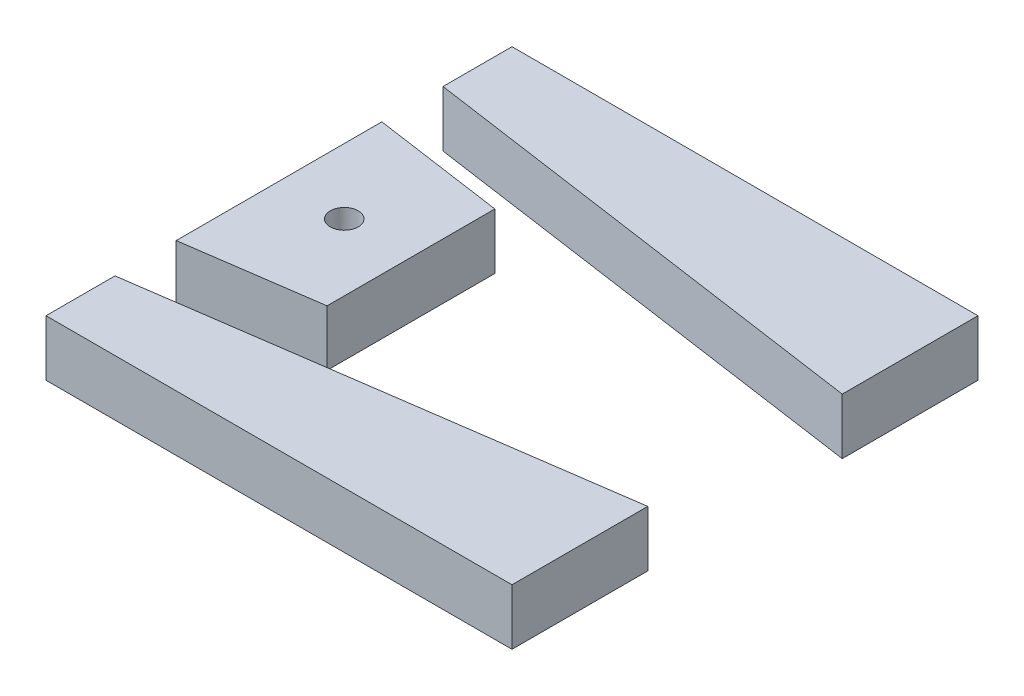
ISO-10303-21;
HEADER;
FILE_DESCRIPTION(('STEP AP214'),'2;1');
FILE_NAME('part.step','',(''),(''),'','','');
FILE_SCHEMA(('AUTOMOTIVE_DESIGN { 1 0 10303 214 1 1 1 1 }'));
ENDSEC;
DATA;
#1=APPLICATION_CONTEXT('core data for automotive mechanical design processes');
#2=APPLICATION_PROTOCOL_DEFINITION('international standard','automotive_design',2000,#1);
#3=PRODUCT_CONTEXT('',#1,'mechanical');
#4=PRODUCT('Part','Part','',(#3));
#5=PRODUCT_RELATED_PRODUCT_CATEGORY('part','',(#4));
#6=PRODUCT_DEFINITION_FORMATION('','',#4);
#7=PRODUCT_DEFINITION_CONTEXT('part definition',#1,'design');
#8=PRODUCT_DEFINITION('design','',#6,#7);
#9=PRODUCT_DEFINITION_SHAPE('','',#8);
#10=(LENGTH_UNIT() NAMED_UNIT(*) SI_UNIT(.MILLI.,.METRE.));
#11=(NAMED_UNIT(*) PLANE_ANGLE_UNIT() SI_UNIT($,.RADIAN.));
#12=(NAMED_UNIT(*) SI_UNIT($,.STERADIAN.) SOLID_ANGLE_UNIT());
#13=UNCERTAINTY_MEASURE_WITH_UNIT(LENGTH_MEASURE(1.E-05),#10,'distance_accuracy_value','');
#14=(GEOMETRIC_REPRESENTATION_CONTEXT(3) GLOBAL_UNCERTAINTY_ASSIGNED_CONTEXT((#13)) GLOBAL_UNIT_ASSIGNED_CONTEXT((#10,
#11,#12)) REPRESENTATION_CONTEXT('',''));
#15=CARTESIAN_POINT('',(0.,0.,0.));
#16=DIRECTION('',(0.,0.,1.));
#17=DIRECTION('',(1.,0.,0.));
#18=AXIS2_PLACEMENT_3D('',#15,#16,#17);
#19=CARTESIAN_POINT('',(-23.8497811945598,6.,-26.0904021186482));
#20=DIRECTION('',(1.,0.,0.));
#21=DIRECTION('',(0.,0.,-1.));
#22=AXIS2_PLACEMENT_3D('',#19,#20,#21);
#23=PLANE('',#22);
#24=DIRECTION('',(0.,1.,0.));
#25=VECTOR('',#24,1.);
#26=CARTESIAN_POINT('',(-23.8497811945598,-0.00100000000000013,-18.6890706547417));
#27=LINE('',#26,#25);
#28=CARTESIAN_POINT('',(-23.8497811945598,0.,-18.6890706547417));
#29=VERTEX_POINT('',#28);
#30=CARTESIAN_POINT('',(-23.8497811945598,6.,-18.6890706547417));
#31=VERTEX_POINT('',#30);
#32=EDGE_CURVE('E65',#29,#31,#27,.T.);
#33=ORIENTED_EDGE('',*,*,#32,.T.);
#34=DIRECTION('',(0.,0.,1.));
#35=VECTOR('',#34,1.);
#36=CARTESIAN_POINT('',(-23.8497811945598,6.,-26.0904021186482));
#37=LINE('',#36,#35);
#38=CARTESIAN_POINT('',(-23.8497811945598,6.,-26.0904021186482));
#39=VERTEX_POINT('',#38);
#40=EDGE_CURVE('E47',#39,#31,#37,.T.);
#41=ORIENTED_EDGE('',*,*,#40,.F.);
#42=DIRECTION('',(0.,-1.,0.));
#43=VECTOR('',#42,1.);
#44=CARTESIAN_POINT('',(-23.8497811945598,6.,-26.0904021186482));
#45=LINE('',#44,#43);
#46=CARTESIAN_POINT('',(-23.8497811945598,0.,-26.0904021186482));
#47=VERTEX_POINT('',#46);
#48=EDGE_CURVE('E104',#39,#47,#45,.T.);
#49=ORIENTED_EDGE('',*,*,#48,.T.);
#50=DIRECTION('',(0.,0.,1.));
#51=VECTOR('',#50,1.);
#52=CARTESIAN_POINT('',(-23.8497811945598,0.,-26.0904021186482));
#53=LINE('',#52,#51);
#54=EDGE_CURVE('E102',#47,#29,#53,.T.);
#55=ORIENTED_EDGE('',*,*,#54,.T.);
#56=EDGE_LOOP('',(#33,#41,#49,#55));
#57=FACE_BOUND('',#56,.T.);
#58=ADVANCED_FACE('F44',(#57),#23,.F.);
#59=CARTESIAN_POINT('',(26.1502188054402,6.,-26.0904021186482));
#60=DIRECTION('',(-1.,0.,0.));
#61=DIRECTION('',(0.,0.,1.));
#62=AXIS2_PLACEMENT_3D('',#59,#60,#61);
#63=PLANE('',#62);
#64=DIRECTION('',(0.,1.,0.));
#65=VECTOR('',#64,1.);
#66=CARTESIAN_POINT('',(26.1502188054402,-0.00100000000000013,-11.5228599887445));
#67=LINE('',#66,#65);
#68=CARTESIAN_POINT('',(26.1502188054402,0.,-11.5228599887445));
#69=VERTEX_POINT('',#68);
#70=CARTESIAN_POINT('',(26.1502188054402,6.,-11.5228599887445));
#71=VERTEX_POINT('',#70);
#72=EDGE_CURVE('E12',#69,#71,#67,.T.);
#73=ORIENTED_EDGE('',*,*,#72,.F.);
#74=DIRECTION('',(0.,0.,-1.));
#75=VECTOR('',#74,1.);
#76=CARTESIAN_POINT('',(26.1502188054402,0.,-26.0904021186482));
#77=LINE('',#76,#75);
#78=CARTESIAN_POINT('',(26.1502188054402,0.,-26.0904021186482));
#79=VERTEX_POINT('',#78);
#80=EDGE_CURVE('E101',#69,#79,#77,.T.);
#81=ORIENTED_EDGE('',*,*,#80,.T.);
#82=DIRECTION('',(0.,-1.,0.));
#83=VECTOR('',#82,1.);
#84=CARTESIAN_POINT('',(26.1502188054402,6.,-26.0904021186482));
#85=LINE('',#84,#83);
#86=CARTESIAN_POINT('',(26.1502188054402,6.,-26.0904021186482));
#87=VERTEX_POINT('',#86);
#88=EDGE_CURVE('E52',#87,#79,#85,.T.);
#89=ORIENTED_EDGE('',*,*,#88,.F.);
#90=DIRECTION('',(0.,0.,-1.));
#91=VECTOR('',#90,1.);
#92=CARTESIAN_POINT('',(26.1502188054402,6.,-26.0904021186482));
#93=LINE('',#92,#91);
#94=EDGE_CURVE('E89',#71,#87,#93,.T.);
#95=ORIENTED_EDGE('',*,*,#94,.F.);
#96=EDGE_LOOP('',(#73,#81,#89,#95));
#97=FACE_BOUND('',#96,.T.);
#98=ADVANCED_FACE('F93',(#97),#63,.F.);
#99=CARTESIAN_POINT('',(0.,6.,0.));
#100=DIRECTION('',(0.,1.,0.));
#101=DIRECTION('',(0.,0.,1.));
#102=AXIS2_PLACEMENT_3D('',#99,#100,#101);
#103=PLANE('',#102);
#104=ORIENTED_EDGE('',*,*,#40,.T.);
#105=DIRECTION('',(0.989884661545493,0.,0.141874440393487));
#106=VECTOR('',#105,1.);
#107=CARTESIAN_POINT('',(2.14462369976373,6.,-14.9634430225427));
#108=LINE('',#107,#106);
#109=EDGE_CURVE('E82',#31,#71,#108,.T.);
#110=ORIENTED_EDGE('',*,*,#109,.T.);
#111=ORIENTED_EDGE('',*,*,#94,.T.);
#112=DIRECTION('',(-1.,0.,0.));
#113=VECTOR('',#112,1.);
#114=CARTESIAN_POINT('',(-23.8497811945598,6.,-26.0904021186482));
#115=LINE('',#114,#113);
#116=EDGE_CURVE('E96',#87,#39,#115,.T.);
#117=ORIENTED_EDGE('',*,*,#116,.T.);
#118=EDGE_LOOP('',(#104,#110,#111,#117));
#119=FACE_BOUND('',#118,.T.);
#120=ADVANCED_FACE('F88',(#119),#103,.T.);
#121=CARTESIAN_POINT('',(0.,0.,0.));
#122=DIRECTION('',(0.,1.,0.));
#123=DIRECTION('',(0.,0.,1.));
#124=AXIS2_PLACEMENT_3D('',#121,#122,#123);
#125=PLANE('',#124);
#126=DIRECTION('',(-0.989884661545493,0.,-0.141874440393487));
#127=VECTOR('',#126,1.);
#128=CARTESIAN_POINT('',(2.14462369976373,0.,-14.9634430225427));
#129=LINE('',#128,#127);
#130=EDGE_CURVE('E59',#69,#29,#129,.T.);
#131=ORIENTED_EDGE('',*,*,#130,.T.);
#132=ORIENTED_EDGE('',*,*,#54,.F.);
#133=DIRECTION('',(-1.,0.,0.));
#134=VECTOR('',#133,1.);
#135=CARTESIAN_POINT('',(-23.8497811945598,0.,-26.0904021186482));
#136=LINE('',#135,#134);
#137=EDGE_CURVE('E113',#79,#47,#136,.T.);
#138=ORIENTED_EDGE('',*,*,#137,.F.);
#139=ORIENTED_EDGE('',*,*,#80,.F.);
#140=EDGE_LOOP('',(#131,#132,#138,#139));
#141=FACE_BOUND('',#140,.T.);
#142=ADVANCED_FACE('F117',(#141),#125,.F.);
#143=CARTESIAN_POINT('',(-23.8497811945598,6.,-26.0904021186482));
#144=DIRECTION('',(0.,0.,1.));
#145=DIRECTION('',(1.,0.,0.));
#146=AXIS2_PLACEMENT_3D('',#143,#144,#145);
#147=PLANE('',#146);
#148=ORIENTED_EDGE('',*,*,#137,.T.);
#149=ORIENTED_EDGE('',*,*,#48,.F.);
#150=ORIENTED_EDGE('',*,*,#116,.F.);
#151=ORIENTED_EDGE('',*,*,#88,.T.);
#152=EDGE_LOOP('',(#148,#149,#150,#151));
#153=FACE_BOUND('',#152,.T.);
#154=ADVANCED_FACE('F118',(#153),#147,.F.);
#155=CARTESIAN_POINT('',(2.14462369976373,-0.00100000000000013,-14.9634430225427));
#156=DIRECTION('',(-0.141874440393487,0.,0.989884661545493));
#157=DIRECTION('',(0.989884661545493,0.,0.141874440393487));
#158=AXIS2_PLACEMENT_3D('',#155,#156,#157);
#159=PLANE('',#158);
#160=ORIENTED_EDGE('',*,*,#72,.T.);
#161=ORIENTED_EDGE('',*,*,#109,.F.);
#162=ORIENTED_EDGE('',*,*,#32,.F.);
#163=ORIENTED_EDGE('',*,*,#130,.F.);
#164=EDGE_LOOP('',(#160,#161,#162,#163));
#165=FACE_BOUND('',#164,.T.);
#166=ADVANCED_FACE('F81',(#165),#159,.T.);
#167=CLOSED_SHELL('',(#58,#98,#120,#142,#154,#166));
#168=MANIFOLD_SOLID_BREP('B2',#167);
#169=CARTESIAN_POINT('',(0.,6.,0.));
#170=DIRECTION('',(0.,1.,0.));
#171=DIRECTION('',(0.,0.,1.));
#172=AXIS2_PLACEMENT_3D('',#169,#170,#171);
#173=PLANE('',#172);
#174=CARTESIAN_POINT('',(-16.8497811945598,6.,-1.09040211864824));
#175=DIRECTION('',(0.,1.,0.));
#176=DIRECTION('',(0.,0.,1.));
#177=AXIS2_PLACEMENT_3D('',#174,#175,#176);
#178=CIRCLE('',#177,1.5);
#179=CARTESIAN_POINT('',(-16.8497811945598,6.,0.409597881351762));
#180=VERTEX_POINT('',#179);
#181=EDGE_CURVE('E269',#180,#180,#178,.T.);
#182=ORIENTED_EDGE('',*,*,#181,.F.);
#183=EDGE_LOOP('',(#182));
#184=FACE_BOUND('',#183,.T.);
#185=DIRECTION('',(0.,0.,-1.));
#186=VECTOR('',#185,1.);
#187=CARTESIAN_POINT('',(-9.69149974245208,6.,0.));
#188=LINE('',#187,#186);
#189=CARTESIAN_POINT('',(-9.69149974245208,6.,7.91262028967642));
#190=VERTEX_POINT('',#189);
#191=CARTESIAN_POINT('',(-9.69149974245208,6.,-10.0934245269729));
#192=VERTEX_POINT('',#191);
#193=EDGE_CURVE('E223',#190,#192,#188,.T.);
#194=ORIENTED_EDGE('',*,*,#193,.T.);
#195=DIRECTION('',(-0.989884661545493,0.,-0.141874440393487));
#196=VECTOR('',#195,1.);
#197=CARTESIAN_POINT('',(1.22243983720607,6.,-8.529192722497));
#198=LINE('',#197,#196);
#199=CARTESIAN_POINT('',(-23.8497811945598,6.,-12.1226490780586));
#200=VERTEX_POINT('',#199);
#201=EDGE_CURVE('E248',#192,#200,#198,.T.);
#202=ORIENTED_EDGE('',*,*,#201,.T.);
#203=DIRECTION('',(0.,0.,1.));
#204=VECTOR('',#203,1.);
#205=CARTESIAN_POINT('',(-23.8497811945598,6.,-26.0904021186482));
#206=LINE('',#205,#204);
#207=CARTESIAN_POINT('',(-23.8497811945598,6.,9.94184484076212));
#208=VERTEX_POINT('',#207);
#209=EDGE_CURVE('E181',#200,#208,#206,.T.);
#210=ORIENTED_EDGE('',*,*,#209,.T.);
#211=DIRECTION('',(-0.989884661545493,0.,0.141874440393487));
#212=VECTOR('',#211,1.);
#213=CARTESIAN_POINT('',(0.916169146001374,6.,6.39228449108039));
#214=LINE('',#213,#212);
#215=EDGE_CURVE('E186',#190,#208,#214,.T.);
#216=ORIENTED_EDGE('',*,*,#215,.F.);
#217=EDGE_LOOP('',(#194,#202,#210,#216));
#218=FACE_BOUND('',#217,.T.);
#219=ADVANCED_FACE('F177',(#184,#218),#173,.T.);
#220=CARTESIAN_POINT('',(0.,0.,0.));
#221=DIRECTION('',(0.,1.,0.));
#222=DIRECTION('',(0.,0.,1.));
#223=AXIS2_PLACEMENT_3D('',#220,#221,#222);
#224=PLANE('',#223);
#225=CARTESIAN_POINT('',(-16.8497811945598,0.,-1.09040211864824));
#226=DIRECTION('',(0.,1.,0.));
#227=DIRECTION('',(0.,0.,1.));
#228=AXIS2_PLACEMENT_3D('',#225,#226,#227);
#229=CIRCLE('',#228,1.5);
#230=CARTESIAN_POINT('',(-16.8497811945598,0.,0.40959788135176));
#231=VERTEX_POINT('',#230);
#232=EDGE_CURVE('E242',#231,#231,#229,.T.);
#233=ORIENTED_EDGE('',*,*,#232,.T.);
#234=EDGE_LOOP('',(#233));
#235=FACE_BOUND('',#234,.T.);
#236=DIRECTION('',(0.989884661545493,0.,0.141874440393487));
#237=VECTOR('',#236,1.);
#238=CARTESIAN_POINT('',(1.22243983720607,0.,-8.529192722497));
#239=LINE('',#238,#237);
#240=CARTESIAN_POINT('',(-23.8497811945598,0.,-12.1226490780586));
#241=VERTEX_POINT('',#240);
#242=CARTESIAN_POINT('',(-9.69149974245208,0.,-10.0934245269729));
#243=VERTEX_POINT('',#242);
#244=EDGE_CURVE('E193',#241,#243,#239,.T.);
#245=ORIENTED_EDGE('',*,*,#244,.T.);
#246=DIRECTION('',(0.,0.,1.));
#247=VECTOR('',#246,1.);
#248=CARTESIAN_POINT('',(-9.69149974245208,0.,0.));
#249=LINE('',#248,#247);
#250=CARTESIAN_POINT('',(-9.69149974245208,0.,7.91262028967642));
#251=VERTEX_POINT('',#250);
#252=EDGE_CURVE('E217',#243,#251,#249,.T.);
#253=ORIENTED_EDGE('',*,*,#252,.T.);
#254=DIRECTION('',(0.989884661545493,0.,-0.141874440393487));
#255=VECTOR('',#254,1.);
#256=CARTESIAN_POINT('',(0.916169146001374,0.,6.39228449108039));
#257=LINE('',#256,#255);
#258=CARTESIAN_POINT('',(-23.8497811945598,0.,9.94184484076211));
#259=VERTEX_POINT('',#258);
#260=EDGE_CURVE('E226',#259,#251,#257,.T.);
#261=ORIENTED_EDGE('',*,*,#260,.F.);
#262=DIRECTION('',(0.,0.,1.));
#263=VECTOR('',#262,1.);
#264=CARTESIAN_POINT('',(-23.8497811945598,0.,-26.0904021186482));
#265=LINE('',#264,#263);
#266=EDGE_CURVE('E237',#241,#259,#265,.T.);
#267=ORIENTED_EDGE('',*,*,#266,.F.);
#268=EDGE_LOOP('',(#245,#253,#261,#267));
#269=FACE_BOUND('',#268,.T.);
#270=ADVANCED_FACE('F179',(#235,#269),#224,.F.);
#271=CARTESIAN_POINT('',(-23.8497811945598,6.,-26.0904021186482));
#272=DIRECTION('',(1.,0.,0.));
#273=DIRECTION('',(0.,0.,-1.));
#274=AXIS2_PLACEMENT_3D('',#271,#272,#273);
#275=PLANE('',#274);
#276=DIRECTION('',(0.,1.,0.));
#277=VECTOR('',#276,1.);
#278=CARTESIAN_POINT('',(-23.8497811945598,-0.00100000000000013,-12.1226490780586));
#279=LINE('',#278,#277);
#280=EDGE_CURVE('E42',#241,#200,#279,.T.);
#281=ORIENTED_EDGE('',*,*,#280,.F.);
#282=ORIENTED_EDGE('',*,*,#266,.T.);
#283=DIRECTION('',(0.,1.,0.));
#284=VECTOR('',#283,1.);
#285=CARTESIAN_POINT('',(-23.8497811945598,-0.00100000000000013,9.94184484076212));
#286=LINE('',#285,#284);
#287=EDGE_CURVE('E231',#259,#208,#286,.T.);
#288=ORIENTED_EDGE('',*,*,#287,.T.);
#289=ORIENTED_EDGE('',*,*,#209,.F.);
#290=EDGE_LOOP('',(#281,#282,#288,#289));
#291=FACE_BOUND('',#290,.T.);
#292=ADVANCED_FACE('F253',(#291),#275,.F.);
#293=CARTESIAN_POINT('',(-9.69149974245208,-0.00100000000000013,0.));
#294=DIRECTION('',(1.,0.,0.));
#295=DIRECTION('',(0.,0.,-1.));
#296=AXIS2_PLACEMENT_3D('',#293,#294,#295);
#297=PLANE('',#296);
#298=DIRECTION('',(0.,1.,0.));
#299=VECTOR('',#298,1.);
#300=CARTESIAN_POINT('',(-9.69149974245208,-0.00100000000000013,-10.0934245269729));
#301=LINE('',#300,#299);
#302=EDGE_CURVE('E235',#243,#192,#301,.T.);
#303=ORIENTED_EDGE('',*,*,#302,.T.);
#304=ORIENTED_EDGE('',*,*,#193,.F.);
#305=DIRECTION('',(0.,1.,0.));
#306=VECTOR('',#305,1.);
#307=CARTESIAN_POINT('',(-9.69149974245208,-0.00100000000000013,7.91262028967642));
#308=LINE('',#307,#306);
#309=EDGE_CURVE('E219',#251,#190,#308,.T.);
#310=ORIENTED_EDGE('',*,*,#309,.F.);
#311=ORIENTED_EDGE('',*,*,#252,.F.);
#312=EDGE_LOOP('',(#303,#304,#310,#311));
#313=FACE_BOUND('',#312,.T.);
#314=ADVANCED_FACE('F221',(#313),#297,.T.);
#315=CARTESIAN_POINT('',(0.916169146001374,-0.00100000000000013,6.39228449108039));
#316=DIRECTION('',(-0.141874440393487,0.,-0.989884661545493));
#317=DIRECTION('',(-0.989884661545493,0.,0.141874440393487));
#318=AXIS2_PLACEMENT_3D('',#315,#316,#317);
#319=PLANE('',#318);
#320=ORIENTED_EDGE('',*,*,#260,.T.);
#321=ORIENTED_EDGE('',*,*,#309,.T.);
#322=ORIENTED_EDGE('',*,*,#215,.T.);
#323=ORIENTED_EDGE('',*,*,#287,.F.);
#324=EDGE_LOOP('',(#320,#321,#322,#323));
#325=FACE_BOUND('',#324,.T.);
#326=ADVANCED_FACE('F229',(#325),#319,.F.);
#327=CARTESIAN_POINT('',(1.22243983720607,-0.00100000000000013,-8.529192722497));
#328=DIRECTION('',(0.141874440393487,0.,-0.989884661545493));
#329=DIRECTION('',(-0.989884661545493,0.,-0.141874440393487));
#330=AXIS2_PLACEMENT_3D('',#327,#328,#329);
#331=PLANE('',#330);
#332=ORIENTED_EDGE('',*,*,#280,.T.);
#333=ORIENTED_EDGE('',*,*,#201,.F.);
#334=ORIENTED_EDGE('',*,*,#302,.F.);
#335=ORIENTED_EDGE('',*,*,#244,.F.);
#336=EDGE_LOOP('',(#332,#333,#334,#335));
#337=FACE_BOUND('',#336,.T.);
#338=ADVANCED_FACE('F276',(#337),#331,.T.);
#339=CARTESIAN_POINT('',(-16.8497811945598,6.,-1.09040211864824));
#340=DIRECTION('',(0.,1.,0.));
#341=DIRECTION('',(0.,0.,1.));
#342=AXIS2_PLACEMENT_3D('',#339,#340,#341);
#343=CYLINDRICAL_SURFACE('',#342,1.5);
#344=ORIENTED_EDGE('',*,*,#232,.F.);
#345=EDGE_LOOP('',(#344));
#346=FACE_BOUND('',#345,.T.);
#347=ORIENTED_EDGE('',*,*,#181,.T.);
#348=EDGE_LOOP('',(#347));
#349=FACE_BOUND('',#348,.T.);
#350=ADVANCED_FACE('F274',(#346,#349),#343,.F.);
#351=CLOSED_SHELL('',(#219,#270,#292,#314,#326,#338,#350));
#352=MANIFOLD_SOLID_BREP('B6',#351);
#353=CARTESIAN_POINT('',(-23.8497811945598,6.,23.9095978813518));
#354=DIRECTION('',(0.,0.,-1.));
#355=DIRECTION('',(-1.,0.,0.));
#356=AXIS2_PLACEMENT_3D('',#353,#354,#355);
#357=PLANE('',#356);
#358=DIRECTION('',(1.,0.,0.));
#359=VECTOR('',#358,1.);
#360=CARTESIAN_POINT('',(-23.8497811945598,0.,23.9095978813518));
#361=LINE('',#360,#359);
#362=CARTESIAN_POINT('',(-23.8497811945598,0.,23.9095978813518));
#363=VERTEX_POINT('',#362);
#364=CARTESIAN_POINT('',(26.1502188054402,0.,23.9095978813518));
#365=VERTEX_POINT('',#364);
#366=EDGE_CURVE('E358',#363,#365,#361,.T.);
#367=ORIENTED_EDGE('',*,*,#366,.T.);
#368=DIRECTION('',(0.,-1.,0.));
#369=VECTOR('',#368,1.);
#370=CARTESIAN_POINT('',(26.1502188054402,6.,23.9095978813518));
#371=LINE('',#370,#369);
#372=CARTESIAN_POINT('',(26.1502188054402,6.,23.9095978813518));
#373=VERTEX_POINT('',#372);
#374=EDGE_CURVE('E330',#373,#365,#371,.T.);
#375=ORIENTED_EDGE('',*,*,#374,.F.);
#376=DIRECTION('',(1.,0.,0.));
#377=VECTOR('',#376,1.);
#378=CARTESIAN_POINT('',(-23.8497811945598,6.,23.9095978813518));
#379=LINE('',#378,#377);
#380=CARTESIAN_POINT('',(-23.8497811945598,6.,23.9095978813518));
#381=VERTEX_POINT('',#380);
#382=EDGE_CURVE('E346',#381,#373,#379,.T.);
#383=ORIENTED_EDGE('',*,*,#382,.F.);
#384=DIRECTION('',(0.,-1.,0.));
#385=VECTOR('',#384,1.);
#386=CARTESIAN_POINT('',(-23.8497811945598,6.,23.9095978813518));
#387=LINE('',#386,#385);
#388=EDGE_CURVE('E175',#381,#363,#387,.T.);
#389=ORIENTED_EDGE('',*,*,#388,.T.);
#390=EDGE_LOOP('',(#367,#375,#383,#389));
#391=FACE_BOUND('',#390,.T.);
#392=ADVANCED_FACE('F322',(#391),#357,.F.);
#393=CARTESIAN_POINT('',(0.,6.,0.));
#394=DIRECTION('',(0.,1.,0.));
#395=DIRECTION('',(0.,0.,1.));
#396=AXIS2_PLACEMENT_3D('',#393,#394,#395);
#397=PLANE('',#396);
#398=DIRECTION('',(0.989884661545493,0.,-0.141874440393487));
#399=VECTOR('',#398,1.);
#400=CARTESIAN_POINT('',(1.83835300855904,6.,12.8265347911261));
#401=LINE('',#400,#399);
#402=CARTESIAN_POINT('',(-23.8497811945598,6.,16.5082664174452));
#403=VERTEX_POINT('',#402);
#404=CARTESIAN_POINT('',(26.1502188054402,6.,9.34205575144805));
#405=VERTEX_POINT('',#404);
#406=EDGE_CURVE('E384',#403,#405,#401,.T.);
#407=ORIENTED_EDGE('',*,*,#406,.F.);
#408=DIRECTION('',(0.,0.,1.));
#409=VECTOR('',#408,1.);
#410=CARTESIAN_POINT('',(-23.8497811945598,6.,-26.0904021186482));
#411=LINE('',#410,#409);
#412=EDGE_CURVE('E374',#403,#381,#411,.T.);
#413=ORIENTED_EDGE('',*,*,#412,.T.);
#414=ORIENTED_EDGE('',*,*,#382,.T.);
#415=DIRECTION('',(0.,0.,-1.));
#416=VECTOR('',#415,1.);
#417=CARTESIAN_POINT('',(26.1502188054402,6.,-26.0904021186482));
#418=LINE('',#417,#416);
#419=EDGE_CURVE('E371',#373,#405,#418,.T.);
#420=ORIENTED_EDGE('',*,*,#419,.T.);
#421=EDGE_LOOP('',(#407,#413,#414,#420));
#422=FACE_BOUND('',#421,.T.);
#423=ADVANCED_FACE('F396',(#422),#397,.T.);
#424=CARTESIAN_POINT('',(0.,0.,0.));
#425=DIRECTION('',(0.,1.,0.));
#426=DIRECTION('',(0.,0.,1.));
#427=AXIS2_PLACEMENT_3D('',#424,#425,#426);
#428=PLANE('',#427);
#429=DIRECTION('',(0.,0.,1.));
#430=VECTOR('',#429,1.);
#431=CARTESIAN_POINT('',(-23.8497811945598,0.,-26.0904021186482));
#432=LINE('',#431,#430);
#433=CARTESIAN_POINT('',(-23.8497811945598,0.,16.5082664174452));
#434=VERTEX_POINT('',#433);
#435=EDGE_CURVE('E366',#434,#363,#432,.T.);
#436=ORIENTED_EDGE('',*,*,#435,.F.);
#437=DIRECTION('',(-0.989884661545493,0.,0.141874440393487));
#438=VECTOR('',#437,1.);
#439=CARTESIAN_POINT('',(1.83835300855904,0.,12.8265347911261));
#440=LINE('',#439,#438);
#441=CARTESIAN_POINT('',(26.1502188054402,0.,9.34205575144805));
#442=VERTEX_POINT('',#441);
#443=EDGE_CURVE('E373',#442,#434,#440,.T.);
#444=ORIENTED_EDGE('',*,*,#443,.F.);
#445=DIRECTION('',(0.,0.,-1.));
#446=VECTOR('',#445,1.);
#447=CARTESIAN_POINT('',(26.1502188054402,0.,-26.0904021186482));
#448=LINE('',#447,#446);
#449=EDGE_CURVE('E365',#365,#442,#448,.T.);
#450=ORIENTED_EDGE('',*,*,#449,.F.);
#451=ORIENTED_EDGE('',*,*,#366,.F.);
#452=EDGE_LOOP('',(#436,#444,#450,#451));
#453=FACE_BOUND('',#452,.T.);
#454=ADVANCED_FACE('F372',(#453),#428,.F.);
#455=CARTESIAN_POINT('',(26.1502188054402,6.,-26.0904021186482));
#456=DIRECTION('',(-1.,0.,0.));
#457=DIRECTION('',(0.,0.,1.));
#458=AXIS2_PLACEMENT_3D('',#455,#456,#457);
#459=PLANE('',#458);
#460=ORIENTED_EDGE('',*,*,#449,.T.);
#461=DIRECTION('',(0.,1.,0.));
#462=VECTOR('',#461,1.);
#463=CARTESIAN_POINT('',(26.1502188054402,-0.00100000000000013,9.34205575144805));
#464=LINE('',#463,#462);
#465=EDGE_CURVE('E337',#442,#405,#464,.T.);
#466=ORIENTED_EDGE('',*,*,#465,.T.);
#467=ORIENTED_EDGE('',*,*,#419,.F.);
#468=ORIENTED_EDGE('',*,*,#374,.T.);
#469=EDGE_LOOP('',(#460,#466,#467,#468));
#470=FACE_BOUND('',#469,.T.);
#471=ADVANCED_FACE('F370',(#470),#459,.F.);
#472=CARTESIAN_POINT('',(-23.8497811945598,6.,-26.0904021186482));
#473=DIRECTION('',(1.,0.,0.));
#474=DIRECTION('',(0.,0.,-1.));
#475=AXIS2_PLACEMENT_3D('',#472,#473,#474);
#476=PLANE('',#475);
#477=ORIENTED_EDGE('',*,*,#412,.F.);
#478=DIRECTION('',(0.,1.,0.));
#479=VECTOR('',#478,1.);
#480=CARTESIAN_POINT('',(-23.8497811945598,-0.00100000000000013,16.5082664174452));
#481=LINE('',#480,#479);
#482=EDGE_CURVE('E381',#434,#403,#481,.T.);
#483=ORIENTED_EDGE('',*,*,#482,.F.);
#484=ORIENTED_EDGE('',*,*,#435,.T.);
#485=ORIENTED_EDGE('',*,*,#388,.F.);
#486=EDGE_LOOP('',(#477,#483,#484,#485));
#487=FACE_BOUND('',#486,.T.);
#488=ADVANCED_FACE('F324',(#487),#476,.F.);
#489=CARTESIAN_POINT('',(1.83835300855904,-0.00100000000000013,12.8265347911261));
#490=DIRECTION('',(0.141874440393487,0.,0.989884661545493));
#491=DIRECTION('',(0.989884661545493,0.,-0.141874440393487));
#492=AXIS2_PLACEMENT_3D('',#489,#490,#491);
#493=PLANE('',#492);
#494=ORIENTED_EDGE('',*,*,#443,.T.);
#495=ORIENTED_EDGE('',*,*,#482,.T.);
#496=ORIENTED_EDGE('',*,*,#406,.T.);
#497=ORIENTED_EDGE('',*,*,#465,.F.);
#498=EDGE_LOOP('',(#494,#495,#496,#497));
#499=FACE_BOUND('',#498,.T.);
#500=ADVANCED_FACE('F389',(#499),#493,.F.);
#501=CLOSED_SHELL('',(#392,#423,#454,#471,#488,#500));
#502=MANIFOLD_SOLID_BREP('B36',#501);
#503=ADVANCED_BREP_SHAPE_REPRESENTATION('',(#18,#168,#352,#502),#14);
#504=SHAPE_DEFINITION_REPRESENTATION(#9,#503);
ENDSEC;
END-ISO-10303-21;
